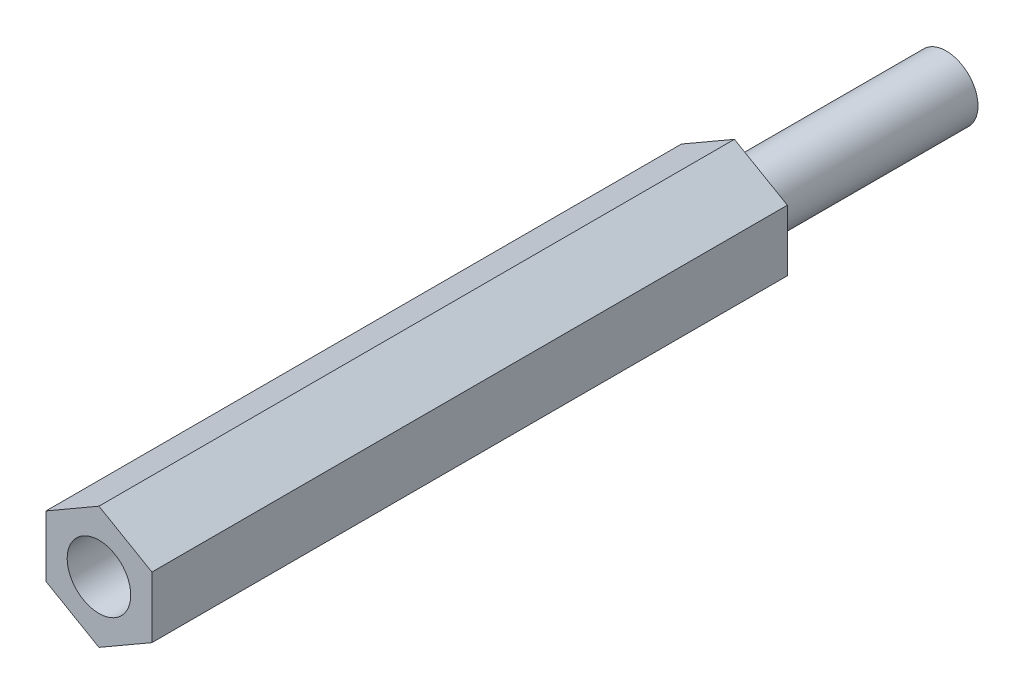
ISO-10303-21;
HEADER;
FILE_DESCRIPTION(('STEP AP214'),'2;1');
FILE_NAME('part.step','',(''),(''),'','','');
FILE_SCHEMA(('AUTOMOTIVE_DESIGN { 1 0 10303 214 1 1 1 1 }'));
ENDSEC;
DATA;
#1=APPLICATION_CONTEXT('core data for automotive mechanical design processes');
#2=APPLICATION_PROTOCOL_DEFINITION('international standard','automotive_design',2000,#1);
#3=PRODUCT_CONTEXT('',#1,'mechanical');
#4=PRODUCT('Part','Part','',(#3));
#5=PRODUCT_RELATED_PRODUCT_CATEGORY('part','',(#4));
#6=PRODUCT_DEFINITION_FORMATION('','',#4);
#7=PRODUCT_DEFINITION_CONTEXT('part definition',#1,'design');
#8=PRODUCT_DEFINITION('design','',#6,#7);
#9=PRODUCT_DEFINITION_SHAPE('','',#8);
#10=(LENGTH_UNIT() NAMED_UNIT(*) SI_UNIT(.MILLI.,.METRE.));
#11=(NAMED_UNIT(*) PLANE_ANGLE_UNIT() SI_UNIT($,.RADIAN.));
#12=(NAMED_UNIT(*) SI_UNIT($,.STERADIAN.) SOLID_ANGLE_UNIT());
#13=UNCERTAINTY_MEASURE_WITH_UNIT(LENGTH_MEASURE(1.E-05),#10,'distance_accuracy_value','');
#14=(GEOMETRIC_REPRESENTATION_CONTEXT(3) GLOBAL_UNCERTAINTY_ASSIGNED_CONTEXT((#13)) GLOBAL_UNIT_ASSIGNED_CONTEXT((#10,
#11,#12)) REPRESENTATION_CONTEXT('',''));
#15=CARTESIAN_POINT('',(0.,0.,0.));
#16=DIRECTION('',(0.,0.,1.));
#17=DIRECTION('',(1.,0.,0.));
#18=AXIS2_PLACEMENT_3D('',#15,#16,#17);
#19=CARTESIAN_POINT('',(0.,0.,30.));
#20=DIRECTION('',(0.,0.,-1.));
#21=DIRECTION('',(-1.,0.,0.));
#22=AXIS2_PLACEMENT_3D('',#19,#20,#21);
#23=CYLINDRICAL_SURFACE('',#22,1.5);
#24=CARTESIAN_POINT('',(0.,0.,30.));
#25=DIRECTION('',(0.,0.,1.));
#26=DIRECTION('',(1.,0.,0.));
#27=AXIS2_PLACEMENT_3D('',#24,#25,#26);
#28=CIRCLE('',#27,1.5);
#29=CARTESIAN_POINT('',(1.5,0.,30.));
#30=VERTEX_POINT('',#29);
#31=EDGE_CURVE('E143',#30,#30,#28,.T.);
#32=ORIENTED_EDGE('',*,*,#31,.T.);
#33=EDGE_LOOP('',(#32));
#34=FACE_BOUND('',#33,.T.);
#35=CARTESIAN_POINT('',(0.,0.,20.));
#36=DIRECTION('',(0.,0.,-1.));
#37=DIRECTION('',(-1.,0.,0.));
#38=AXIS2_PLACEMENT_3D('',#35,#36,#37);
#39=CIRCLE('',#38,1.5);
#40=CARTESIAN_POINT('',(-1.5,0.,20.));
#41=VERTEX_POINT('',#40);
#42=EDGE_CURVE('E249',#41,#41,#39,.T.);
#43=ORIENTED_EDGE('',*,*,#42,.T.);
#44=EDGE_LOOP('',(#43));
#45=FACE_BOUND('',#44,.T.);
#46=ADVANCED_FACE('F53',(#34,#45),#23,.F.);
#47=CARTESIAN_POINT('',(0.,0.,30.));
#48=DIRECTION('',(0.,0.,1.));
#49=DIRECTION('',(1.,0.,0.));
#50=AXIS2_PLACEMENT_3D('',#47,#48,#49);
#51=PLANE('',#50);
#52=DIRECTION('',(0.866025403784439,-0.5,0.));
#53=VECTOR('',#52,1.);
#54=CARTESIAN_POINT('',(-2.5,-1.44337567297406,30.));
#55=LINE('',#54,#53);
#56=CARTESIAN_POINT('',(-2.5,-1.44337567297406,30.));
#57=VERTEX_POINT('',#56);
#58=CARTESIAN_POINT('',(0.,-2.88675134594813,30.));
#59=VERTEX_POINT('',#58);
#60=EDGE_CURVE('E150',#57,#59,#55,.T.);
#61=ORIENTED_EDGE('',*,*,#60,.T.);
#62=DIRECTION('',(0.866025403784438,0.5,0.));
#63=VECTOR('',#62,1.);
#64=CARTESIAN_POINT('',(0.,-2.88675134594813,30.));
#65=LINE('',#64,#63);
#66=CARTESIAN_POINT('',(2.5,-1.44337567297406,30.));
#67=VERTEX_POINT('',#66);
#68=EDGE_CURVE('E107',#59,#67,#65,.T.);
#69=ORIENTED_EDGE('',*,*,#68,.T.);
#70=DIRECTION('',(0.,1.,0.));
#71=VECTOR('',#70,1.);
#72=CARTESIAN_POINT('',(2.5,-1.44337567297406,30.));
#73=LINE('',#72,#71);
#74=CARTESIAN_POINT('',(2.5,1.44337567297407,30.));
#75=VERTEX_POINT('',#74);
#76=EDGE_CURVE('E121',#67,#75,#73,.T.);
#77=ORIENTED_EDGE('',*,*,#76,.T.);
#78=DIRECTION('',(-0.866025403784439,0.5,0.));
#79=VECTOR('',#78,1.);
#80=CARTESIAN_POINT('',(2.5,1.44337567297407,30.));
#81=LINE('',#80,#79);
#82=CARTESIAN_POINT('',(0.,2.88675134594813,30.));
#83=VERTEX_POINT('',#82);
#84=EDGE_CURVE('E114',#75,#83,#81,.T.);
#85=ORIENTED_EDGE('',*,*,#84,.T.);
#86=DIRECTION('',(-0.866025403784439,-0.5,0.));
#87=VECTOR('',#86,1.);
#88=CARTESIAN_POINT('',(0.,2.88675134594813,30.));
#89=LINE('',#88,#87);
#90=CARTESIAN_POINT('',(-2.5,1.44337567297406,30.));
#91=VERTEX_POINT('',#90);
#92=EDGE_CURVE('E119',#83,#91,#89,.T.);
#93=ORIENTED_EDGE('',*,*,#92,.T.);
#94=DIRECTION('',(0.,-1.,0.));
#95=VECTOR('',#94,1.);
#96=CARTESIAN_POINT('',(-2.5,1.44337567297406,30.));
#97=LINE('',#96,#95);
#98=EDGE_CURVE('E70',#91,#57,#97,.T.);
#99=ORIENTED_EDGE('',*,*,#98,.T.);
#100=EDGE_LOOP('',(#61,#69,#77,#85,#93,#99));
#101=FACE_BOUND('',#100,.T.);
#102=ORIENTED_EDGE('',*,*,#31,.F.);
#103=EDGE_LOOP('',(#102));
#104=FACE_BOUND('',#103,.T.);
#105=ADVANCED_FACE('F116',(#101,#104),#51,.T.);
#106=CARTESIAN_POINT('',(0.,0.,0.));
#107=DIRECTION('',(0.,0.,1.));
#108=DIRECTION('',(1.,0.,0.));
#109=AXIS2_PLACEMENT_3D('',#106,#107,#108);
#110=PLANE('',#109);
#111=DIRECTION('',(0.866025403784439,-0.5,0.));
#112=VECTOR('',#111,1.);
#113=CARTESIAN_POINT('',(-2.5,-1.44337567297406,0.));
#114=LINE('',#113,#112);
#115=CARTESIAN_POINT('',(-2.5,-1.44337567297406,0.));
#116=VERTEX_POINT('',#115);
#117=CARTESIAN_POINT('',(0.,-2.88675134594813,0.));
#118=VERTEX_POINT('',#117);
#119=EDGE_CURVE('E139',#116,#118,#114,.T.);
#120=ORIENTED_EDGE('',*,*,#119,.F.);
#121=DIRECTION('',(0.,-1.,0.));
#122=VECTOR('',#121,1.);
#123=CARTESIAN_POINT('',(-2.5,1.44337567297406,0.));
#124=LINE('',#123,#122);
#125=CARTESIAN_POINT('',(-2.5,1.44337567297406,0.));
#126=VERTEX_POINT('',#125);
#127=EDGE_CURVE('E99',#126,#116,#124,.T.);
#128=ORIENTED_EDGE('',*,*,#127,.F.);
#129=DIRECTION('',(-0.866025403784439,-0.5,0.));
#130=VECTOR('',#129,1.);
#131=CARTESIAN_POINT('',(0.,2.88675134594813,0.));
#132=LINE('',#131,#130);
#133=CARTESIAN_POINT('',(0.,2.88675134594813,0.));
#134=VERTEX_POINT('',#133);
#135=EDGE_CURVE('E93',#134,#126,#132,.T.);
#136=ORIENTED_EDGE('',*,*,#135,.F.);
#137=DIRECTION('',(-0.866025403784439,0.5,0.));
#138=VECTOR('',#137,1.);
#139=CARTESIAN_POINT('',(2.5,1.44337567297407,0.));
#140=LINE('',#139,#138);
#141=CARTESIAN_POINT('',(2.5,1.44337567297407,0.));
#142=VERTEX_POINT('',#141);
#143=EDGE_CURVE('E129',#142,#134,#140,.T.);
#144=ORIENTED_EDGE('',*,*,#143,.F.);
#145=DIRECTION('',(0.,1.,0.));
#146=VECTOR('',#145,1.);
#147=CARTESIAN_POINT('',(2.5,-1.44337567297406,0.));
#148=LINE('',#147,#146);
#149=CARTESIAN_POINT('',(2.5,-1.44337567297406,0.));
#150=VERTEX_POINT('',#149);
#151=EDGE_CURVE('E145',#150,#142,#148,.T.);
#152=ORIENTED_EDGE('',*,*,#151,.F.);
#153=DIRECTION('',(0.866025403784438,0.5,0.));
#154=VECTOR('',#153,1.);
#155=CARTESIAN_POINT('',(0.,-2.88675134594813,0.));
#156=LINE('',#155,#154);
#157=EDGE_CURVE('E142',#118,#150,#156,.T.);
#158=ORIENTED_EDGE('',*,*,#157,.F.);
#159=EDGE_LOOP('',(#120,#128,#136,#144,#152,#158));
#160=FACE_BOUND('',#159,.T.);
#161=CARTESIAN_POINT('',(0.,0.,0.));
#162=DIRECTION('',(0.,0.,1.));
#163=DIRECTION('',(1.,0.,0.));
#164=AXIS2_PLACEMENT_3D('',#161,#162,#163);
#165=CIRCLE('',#164,1.5);
#166=CARTESIAN_POINT('',(1.5,0.,0.));
#167=VERTEX_POINT('',#166);
#168=EDGE_CURVE('E248',#167,#167,#165,.F.);
#169=ORIENTED_EDGE('',*,*,#168,.F.);
#170=EDGE_LOOP('',(#169));
#171=FACE_BOUND('',#170,.T.);
#172=ADVANCED_FACE('F159',(#160,#171),#110,.F.);
#173=CARTESIAN_POINT('',(-2.5,-1.44337567297406,30.));
#174=DIRECTION('',(0.5,0.866025403784439,0.));
#175=DIRECTION('',(-0.866025403784439,0.5,0.));
#176=AXIS2_PLACEMENT_3D('',#173,#174,#175);
#177=PLANE('',#176);
#178=ORIENTED_EDGE('',*,*,#119,.T.);
#179=DIRECTION('',(0.,0.,-1.));
#180=VECTOR('',#179,1.);
#181=CARTESIAN_POINT('',(0.,-2.88675134594813,30.));
#182=LINE('',#181,#180);
#183=EDGE_CURVE('E12',#59,#118,#182,.T.);
#184=ORIENTED_EDGE('',*,*,#183,.F.);
#185=ORIENTED_EDGE('',*,*,#60,.F.);
#186=DIRECTION('',(0.,0.,-1.));
#187=VECTOR('',#186,1.);
#188=CARTESIAN_POINT('',(-2.5,-1.44337567297406,30.));
#189=LINE('',#188,#187);
#190=EDGE_CURVE('E135',#57,#116,#189,.T.);
#191=ORIENTED_EDGE('',*,*,#190,.T.);
#192=EDGE_LOOP('',(#178,#184,#185,#191));
#193=FACE_BOUND('',#192,.T.);
#194=ADVANCED_FACE('F55',(#193),#177,.F.);
#195=CARTESIAN_POINT('',(0.,-2.88675134594813,30.));
#196=DIRECTION('',(-0.5,0.866025403784439,0.));
#197=DIRECTION('',(-0.866025403784439,-0.5,0.));
#198=AXIS2_PLACEMENT_3D('',#195,#196,#197);
#199=PLANE('',#198);
#200=ORIENTED_EDGE('',*,*,#157,.T.);
#201=DIRECTION('',(0.,0.,-1.));
#202=VECTOR('',#201,1.);
#203=CARTESIAN_POINT('',(2.5,-1.44337567297406,30.));
#204=LINE('',#203,#202);
#205=EDGE_CURVE('E62',#67,#150,#204,.T.);
#206=ORIENTED_EDGE('',*,*,#205,.F.);
#207=ORIENTED_EDGE('',*,*,#68,.F.);
#208=ORIENTED_EDGE('',*,*,#183,.T.);
#209=EDGE_LOOP('',(#200,#206,#207,#208));
#210=FACE_BOUND('',#209,.T.);
#211=ADVANCED_FACE('F192',(#210),#199,.F.);
#212=CARTESIAN_POINT('',(2.5,-1.44337567297406,30.));
#213=DIRECTION('',(-1.,0.,0.));
#214=DIRECTION('',(0.,-1.,0.));
#215=AXIS2_PLACEMENT_3D('',#212,#213,#214);
#216=PLANE('',#215);
#217=ORIENTED_EDGE('',*,*,#151,.T.);
#218=DIRECTION('',(0.,0.,-1.));
#219=VECTOR('',#218,1.);
#220=CARTESIAN_POINT('',(2.5,1.44337567297407,30.));
#221=LINE('',#220,#219);
#222=EDGE_CURVE('E130',#75,#142,#221,.T.);
#223=ORIENTED_EDGE('',*,*,#222,.F.);
#224=ORIENTED_EDGE('',*,*,#76,.F.);
#225=ORIENTED_EDGE('',*,*,#205,.T.);
#226=EDGE_LOOP('',(#217,#223,#224,#225));
#227=FACE_BOUND('',#226,.T.);
#228=ADVANCED_FACE('F156',(#227),#216,.F.);
#229=CARTESIAN_POINT('',(2.5,1.44337567297407,30.));
#230=DIRECTION('',(-0.5,-0.866025403784439,0.));
#231=DIRECTION('',(0.866025403784439,-0.5,0.));
#232=AXIS2_PLACEMENT_3D('',#229,#230,#231);
#233=PLANE('',#232);
#234=ORIENTED_EDGE('',*,*,#143,.T.);
#235=DIRECTION('',(0.,0.,-1.));
#236=VECTOR('',#235,1.);
#237=CARTESIAN_POINT('',(0.,2.88675134594813,30.));
#238=LINE('',#237,#236);
#239=EDGE_CURVE('E126',#83,#134,#238,.T.);
#240=ORIENTED_EDGE('',*,*,#239,.F.);
#241=ORIENTED_EDGE('',*,*,#84,.F.);
#242=ORIENTED_EDGE('',*,*,#222,.T.);
#243=EDGE_LOOP('',(#234,#240,#241,#242));
#244=FACE_BOUND('',#243,.T.);
#245=ADVANCED_FACE('F127',(#244),#233,.F.);
#246=CARTESIAN_POINT('',(0.,2.88675134594813,30.));
#247=DIRECTION('',(0.5,-0.866025403784439,0.));
#248=DIRECTION('',(0.866025403784439,0.5,0.));
#249=AXIS2_PLACEMENT_3D('',#246,#247,#248);
#250=PLANE('',#249);
#251=ORIENTED_EDGE('',*,*,#135,.T.);
#252=DIRECTION('',(0.,0.,-1.));
#253=VECTOR('',#252,1.);
#254=CARTESIAN_POINT('',(-2.5,1.44337567297406,30.));
#255=LINE('',#254,#253);
#256=EDGE_CURVE('E131',#91,#126,#255,.T.);
#257=ORIENTED_EDGE('',*,*,#256,.F.);
#258=ORIENTED_EDGE('',*,*,#92,.F.);
#259=ORIENTED_EDGE('',*,*,#239,.T.);
#260=EDGE_LOOP('',(#251,#257,#258,#259));
#261=FACE_BOUND('',#260,.T.);
#262=ADVANCED_FACE('F133',(#261),#250,.F.);
#263=CARTESIAN_POINT('',(-2.5,1.44337567297406,30.));
#264=DIRECTION('',(1.,0.,0.));
#265=DIRECTION('',(0.,1.,0.));
#266=AXIS2_PLACEMENT_3D('',#263,#264,#265);
#267=PLANE('',#266);
#268=ORIENTED_EDGE('',*,*,#127,.T.);
#269=ORIENTED_EDGE('',*,*,#190,.F.);
#270=ORIENTED_EDGE('',*,*,#98,.F.);
#271=ORIENTED_EDGE('',*,*,#256,.T.);
#272=EDGE_LOOP('',(#268,#269,#270,#271));
#273=FACE_BOUND('',#272,.T.);
#274=ADVANCED_FACE('F164',(#273),#267,.F.);
#275=CARTESIAN_POINT('',(0.,0.,20.));
#276=DIRECTION('',(0.,0.,-1.));
#277=DIRECTION('',(-1.,0.,0.));
#278=AXIS2_PLACEMENT_3D('',#275,#276,#277);
#279=PLANE('',#278);
#280=ORIENTED_EDGE('',*,*,#42,.F.);
#281=EDGE_LOOP('',(#280));
#282=FACE_BOUND('',#281,.T.);
#283=ADVANCED_FACE('F166',(#282),#279,.F.);
#284=CARTESIAN_POINT('',(0.,0.,-10.));
#285=DIRECTION('',(0.,0.,1.));
#286=DIRECTION('',(1.,0.,0.));
#287=AXIS2_PLACEMENT_3D('',#284,#285,#286);
#288=CYLINDRICAL_SURFACE('',#287,1.5);
#289=CARTESIAN_POINT('',(0.,0.,-10.));
#290=DIRECTION('',(0.,0.,-1.));
#291=DIRECTION('',(-1.,0.,0.));
#292=AXIS2_PLACEMENT_3D('',#289,#290,#291);
#293=CIRCLE('',#292,1.5);
#294=CARTESIAN_POINT('',(-1.5,0.,-10.));
#295=VERTEX_POINT('',#294);
#296=EDGE_CURVE('E247',#295,#295,#293,.T.);
#297=ORIENTED_EDGE('',*,*,#296,.F.);
#298=EDGE_LOOP('',(#297));
#299=FACE_BOUND('',#298,.T.);
#300=ORIENTED_EDGE('',*,*,#168,.T.);
#301=EDGE_LOOP('',(#300));
#302=FACE_BOUND('',#301,.T.);
#303=ADVANCED_FACE('F172',(#299,#302),#288,.T.);
#304=CARTESIAN_POINT('',(0.,0.,-10.));
#305=DIRECTION('',(0.,0.,-1.));
#306=DIRECTION('',(-1.,0.,0.));
#307=AXIS2_PLACEMENT_3D('',#304,#305,#306);
#308=PLANE('',#307);
#309=ORIENTED_EDGE('',*,*,#296,.T.);
#310=EDGE_LOOP('',(#309));
#311=FACE_BOUND('',#310,.T.);
#312=ADVANCED_FACE('F233',(#311),#308,.T.);
#313=CLOSED_SHELL('',(#46,#105,#172,#194,#211,#228,#245,#262,#274,#283,#303,#312));
#314=MANIFOLD_SOLID_BREP('B2',#313);
#315=ADVANCED_BREP_SHAPE_REPRESENTATION('',(#18,#314),#14);
#316=SHAPE_DEFINITION_REPRESENTATION(#9,#315);
ENDSEC;
END-ISO-10303-21;
